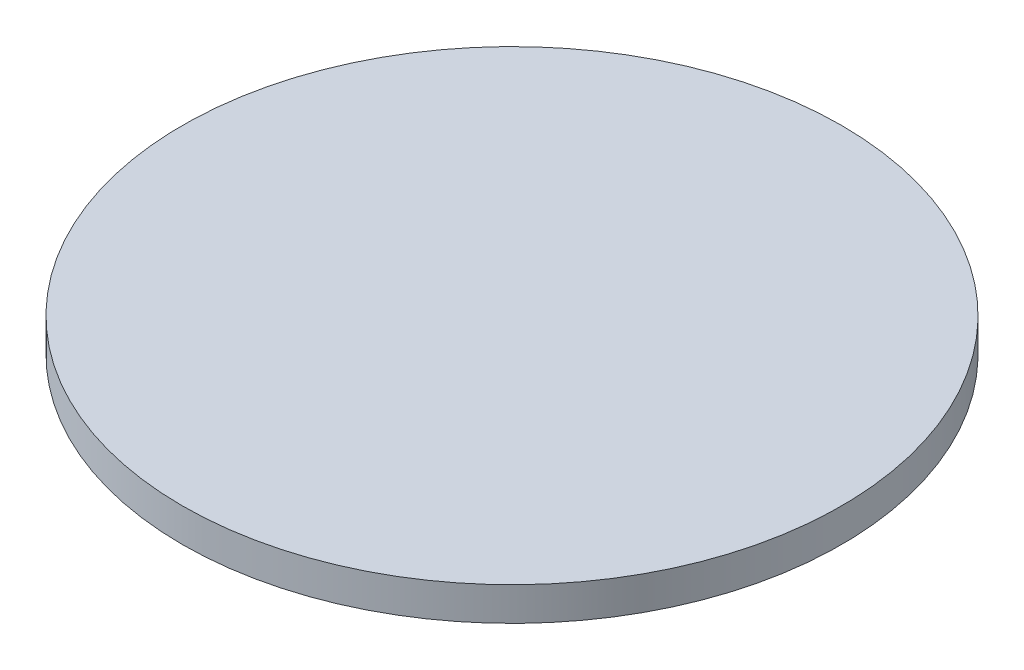
ISO-10303-21;
HEADER;
FILE_DESCRIPTION(('STEP AP214'),'2;1');
FILE_NAME('part.step','',(''),(''),'','','');
FILE_SCHEMA(('AUTOMOTIVE_DESIGN { 1 0 10303 214 1 1 1 1 }'));
ENDSEC;
DATA;
#1=APPLICATION_CONTEXT('core data for automotive mechanical design processes');
#2=APPLICATION_PROTOCOL_DEFINITION('international standard','automotive_design',2000,#1);
#3=PRODUCT_CONTEXT('',#1,'mechanical');
#4=PRODUCT('Part','Part','',(#3));
#5=PRODUCT_RELATED_PRODUCT_CATEGORY('part','',(#4));
#6=PRODUCT_DEFINITION_FORMATION('','',#4);
#7=PRODUCT_DEFINITION_CONTEXT('part definition',#1,'design');
#8=PRODUCT_DEFINITION('design','',#6,#7);
#9=PRODUCT_DEFINITION_SHAPE('','',#8);
#10=(LENGTH_UNIT() NAMED_UNIT(*) SI_UNIT(.MILLI.,.METRE.));
#11=(NAMED_UNIT(*) PLANE_ANGLE_UNIT() SI_UNIT($,.RADIAN.));
#12=(NAMED_UNIT(*) SI_UNIT($,.STERADIAN.) SOLID_ANGLE_UNIT());
#13=UNCERTAINTY_MEASURE_WITH_UNIT(LENGTH_MEASURE(1.E-05),#10,'distance_accuracy_value','');
#14=(GEOMETRIC_REPRESENTATION_CONTEXT(3) GLOBAL_UNCERTAINTY_ASSIGNED_CONTEXT((#13)) GLOBAL_UNIT_ASSIGNED_CONTEXT((#10,
#11,#12)) REPRESENTATION_CONTEXT('',''));
#15=CARTESIAN_POINT('',(0.,0.,0.));
#16=DIRECTION('',(0.,0.,1.));
#17=DIRECTION('',(1.,0.,0.));
#18=AXIS2_PLACEMENT_3D('',#15,#16,#17);
#19=CARTESIAN_POINT('',(0.,6.,0.));
#20=DIRECTION('',(0.,-1.,0.));
#21=DIRECTION('',(0.,0.,-1.));
#22=AXIS2_PLACEMENT_3D('',#19,#20,#21);
#23=CYLINDRICAL_SURFACE('',#22,59.);
#24=CARTESIAN_POINT('',(0.,6.,0.));
#25=DIRECTION('',(0.,1.,0.));
#26=DIRECTION('',(0.,0.,1.));
#27=AXIS2_PLACEMENT_3D('',#24,#25,#26);
#28=CIRCLE('',#27,59.);
#29=CARTESIAN_POINT('',(0.,6.,59.));
#30=VERTEX_POINT('',#29);
#31=EDGE_CURVE('E10',#30,#30,#28,.T.);
#32=ORIENTED_EDGE('',*,*,#31,.F.);
#33=EDGE_LOOP('',(#32));
#34=FACE_BOUND('',#33,.T.);
#35=CARTESIAN_POINT('',(0.,0.,0.));
#36=DIRECTION('',(0.,1.,0.));
#37=DIRECTION('',(0.,0.,1.));
#38=AXIS2_PLACEMENT_3D('',#35,#36,#37);
#39=CIRCLE('',#38,59.);
#40=CARTESIAN_POINT('',(0.,0.,59.));
#41=VERTEX_POINT('',#40);
#42=EDGE_CURVE('E40',#41,#41,#39,.T.);
#43=ORIENTED_EDGE('',*,*,#42,.T.);
#44=EDGE_LOOP('',(#43));
#45=FACE_BOUND('',#44,.T.);
#46=ADVANCED_FACE('F37',(#34,#45),#23,.T.);
#47=CARTESIAN_POINT('',(0.,6.,0.));
#48=DIRECTION('',(0.,1.,0.));
#49=DIRECTION('',(0.,0.,1.));
#50=AXIS2_PLACEMENT_3D('',#47,#48,#49);
#51=PLANE('',#50);
#52=ORIENTED_EDGE('',*,*,#31,.T.);
#53=EDGE_LOOP('',(#52));
#54=FACE_BOUND('',#53,.T.);
#55=ADVANCED_FACE('F80',(#54),#51,.T.);
#56=CARTESIAN_POINT('',(0.,0.,0.));
#57=DIRECTION('',(0.,1.,0.));
#58=DIRECTION('',(0.,0.,1.));
#59=AXIS2_PLACEMENT_3D('',#56,#57,#58);
#60=PLANE('',#59);
#61=CARTESIAN_POINT('',(0.,0.,0.));
#62=DIRECTION('',(0.,1.,0.));
#63=DIRECTION('',(0.,0.,1.));
#64=AXIS2_PLACEMENT_3D('',#61,#62,#63);
#65=CIRCLE('',#64,6.);
#66=CARTESIAN_POINT('',(0.,0.,6.));
#67=VERTEX_POINT('',#66);
#68=EDGE_CURVE('E53',#67,#67,#65,.T.);
#69=ORIENTED_EDGE('',*,*,#68,.T.);
#70=EDGE_LOOP('',(#69));
#71=FACE_BOUND('',#70,.T.);
#72=ORIENTED_EDGE('',*,*,#42,.F.);
#73=EDGE_LOOP('',(#72));
#74=FACE_BOUND('',#73,.T.);
#75=ADVANCED_FACE('F74',(#71,#74),#60,.F.);
#76=CARTESIAN_POINT('',(0.,0.,0.));
#77=DIRECTION('',(0.,1.,0.));
#78=DIRECTION('',(0.,0.,1.));
#79=AXIS2_PLACEMENT_3D('',#76,#77,#78);
#80=CONICAL_SURFACE('',#79,6.,0.523598775598299);
#81=CARTESIAN_POINT('',(0.,-2.,0.));
#82=DIRECTION('',(0.,1.,0.));
#83=DIRECTION('',(0.,0.,1.));
#84=AXIS2_PLACEMENT_3D('',#81,#82,#83);
#85=CIRCLE('',#84,4.84529946162075);
#86=CARTESIAN_POINT('',(0.,-2.,4.84529946162075));
#87=VERTEX_POINT('',#86);
#88=EDGE_CURVE('E49',#87,#87,#85,.T.);
#89=ORIENTED_EDGE('',*,*,#88,.T.);
#90=EDGE_LOOP('',(#89));
#91=FACE_BOUND('',#90,.T.);
#92=ORIENTED_EDGE('',*,*,#68,.F.);
#93=EDGE_LOOP('',(#92));
#94=FACE_BOUND('',#93,.T.);
#95=ADVANCED_FACE('F68',(#91,#94),#80,.T.);
#96=CARTESIAN_POINT('',(0.,-2.,0.));
#97=DIRECTION('',(0.,1.,0.));
#98=DIRECTION('',(0.,0.,1.));
#99=AXIS2_PLACEMENT_3D('',#96,#97,#98);
#100=PLANE('',#99);
#101=CARTESIAN_POINT('',(0.,-2.,0.));
#102=DIRECTION('',(0.,-1.,0.));
#103=DIRECTION('',(0.,0.,-1.));
#104=AXIS2_PLACEMENT_3D('',#101,#102,#103);
#105=CIRCLE('',#104,4.26282607598503);
#106=CARTESIAN_POINT('',(0.,-2.,-4.26282607598503));
#107=VERTEX_POINT('',#106);
#108=EDGE_CURVE('E59',#107,#107,#105,.T.);
#109=ORIENTED_EDGE('',*,*,#108,.F.);
#110=EDGE_LOOP('',(#109));
#111=FACE_BOUND('',#110,.T.);
#112=ORIENTED_EDGE('',*,*,#88,.F.);
#113=EDGE_LOOP('',(#112));
#114=FACE_BOUND('',#113,.T.);
#115=ADVANCED_FACE('F65',(#111,#114),#100,.F.);
#116=CARTESIAN_POINT('',(0.,-2.,0.));
#117=DIRECTION('',(0.,-1.,0.));
#118=DIRECTION('',(0.,0.,-1.));
#119=AXIS2_PLACEMENT_3D('',#116,#117,#118);
#120=CONICAL_SURFACE('',#119,4.26282607598503,0.78539816339745);
#121=CARTESIAN_POINT('',(0.,-1.5,0.));
#122=DIRECTION('',(0.,-1.,0.));
#123=DIRECTION('',(0.,0.,-1.));
#124=AXIS2_PLACEMENT_3D('',#121,#122,#123);
#125=CIRCLE('',#124,3.76282607598502);
#126=CARTESIAN_POINT('',(0.,-1.5,-3.76282607598502));
#127=VERTEX_POINT('',#126);
#128=EDGE_CURVE('E56',#127,#127,#125,.T.);
#129=ORIENTED_EDGE('',*,*,#128,.F.);
#130=EDGE_LOOP('',(#129));
#131=FACE_BOUND('',#130,.T.);
#132=ORIENTED_EDGE('',*,*,#108,.T.);
#133=EDGE_LOOP('',(#132));
#134=FACE_BOUND('',#133,.T.);
#135=ADVANCED_FACE('F63',(#131,#134),#120,.F.);
#136=CARTESIAN_POINT('',(0.,-1.5,0.));
#137=DIRECTION('',(0.,-1.,0.));
#138=DIRECTION('',(0.,0.,-1.));
#139=AXIS2_PLACEMENT_3D('',#136,#137,#138);
#140=PLANE('',#139);
#141=ORIENTED_EDGE('',*,*,#128,.T.);
#142=EDGE_LOOP('',(#141));
#143=FACE_BOUND('',#142,.T.);
#144=ADVANCED_FACE('F94',(#143),#140,.T.);
#145=CLOSED_SHELL('',(#46,#55,#75,#95,#115,#135,#144));
#146=MANIFOLD_SOLID_BREP('B2',#145);
#147=ADVANCED_BREP_SHAPE_REPRESENTATION('',(#18,#146),#14);
#148=SHAPE_DEFINITION_REPRESENTATION(#9,#147);
ENDSEC;
END-ISO-10303-21;
